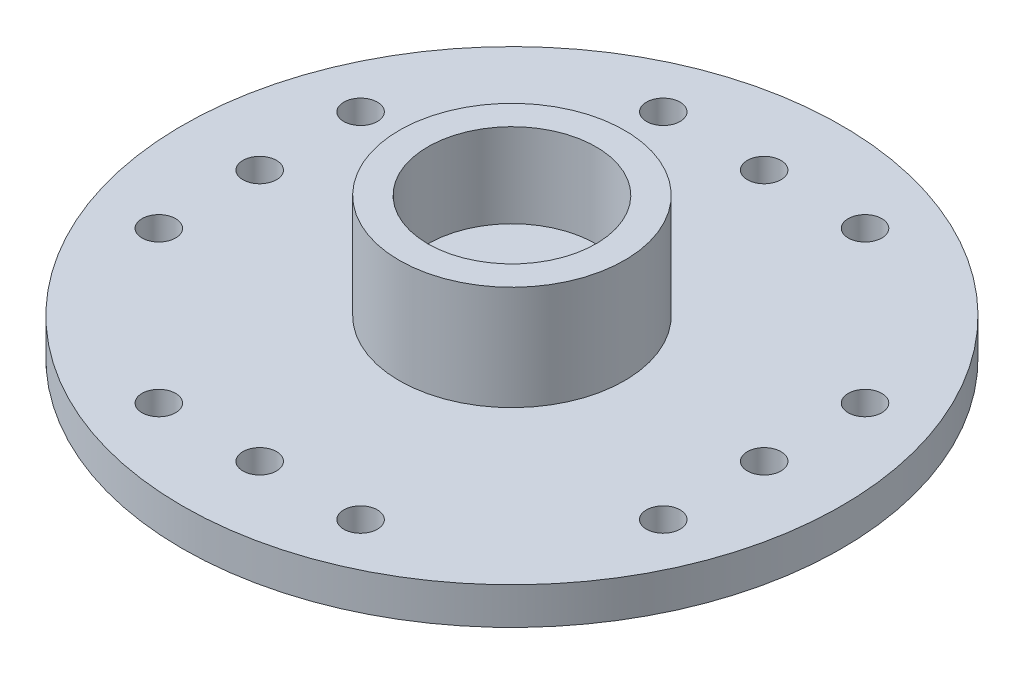
ISO-10303-21;
HEADER;
FILE_DESCRIPTION(('STEP AP214'),'2;1');
FILE_NAME('part.step','',(''),(''),'','','');
FILE_SCHEMA(('AUTOMOTIVE_DESIGN { 1 0 10303 214 1 1 1 1 }'));
ENDSEC;
DATA;
#1=APPLICATION_CONTEXT('core data for automotive mechanical design processes');
#2=APPLICATION_PROTOCOL_DEFINITION('international standard','automotive_design',2000,#1);
#3=PRODUCT_CONTEXT('',#1,'mechanical');
#4=PRODUCT('Part','Part','',(#3));
#5=PRODUCT_RELATED_PRODUCT_CATEGORY('part','',(#4));
#6=PRODUCT_DEFINITION_FORMATION('','',#4);
#7=PRODUCT_DEFINITION_CONTEXT('part definition',#1,'design');
#8=PRODUCT_DEFINITION('design','',#6,#7);
#9=PRODUCT_DEFINITION_SHAPE('','',#8);
#10=(LENGTH_UNIT() NAMED_UNIT(*) SI_UNIT(.MILLI.,.METRE.));
#11=(NAMED_UNIT(*) PLANE_ANGLE_UNIT() SI_UNIT($,.RADIAN.));
#12=(NAMED_UNIT(*) SI_UNIT($,.STERADIAN.) SOLID_ANGLE_UNIT());
#13=UNCERTAINTY_MEASURE_WITH_UNIT(LENGTH_MEASURE(1.E-05),#10,'distance_accuracy_value','');
#14=(GEOMETRIC_REPRESENTATION_CONTEXT(3) GLOBAL_UNCERTAINTY_ASSIGNED_CONTEXT((#13)) GLOBAL_UNIT_ASSIGNED_CONTEXT((#10,
#11,#12)) REPRESENTATION_CONTEXT('',''));
#15=CARTESIAN_POINT('',(0.,0.,0.));
#16=DIRECTION('',(0.,0.,1.));
#17=DIRECTION('',(1.,0.,0.));
#18=AXIS2_PLACEMENT_3D('',#15,#16,#17);
#19=CARTESIAN_POINT('',(0.,-0.000999999999999916,0.));
#20=DIRECTION('',(0.,1.,0.));
#21=DIRECTION('',(0.,0.,1.));
#22=AXIS2_PLACEMENT_3D('',#19,#20,#21);
#23=CYLINDRICAL_SURFACE('',#22,1.);
#24=CARTESIAN_POINT('',(0.,1.7,0.));
#25=DIRECTION('',(0.,1.,0.));
#26=DIRECTION('',(0.,0.,1.));
#27=AXIS2_PLACEMENT_3D('',#24,#25,#26);
#28=CIRCLE('',#27,1.);
#29=CARTESIAN_POINT('',(0.,1.7,1.));
#30=VERTEX_POINT('',#29);
#31=EDGE_CURVE('E54',#30,#30,#28,.T.);
#32=ORIENTED_EDGE('',*,*,#31,.T.);
#33=EDGE_LOOP('',(#32));
#34=FACE_BOUND('',#33,.T.);
#35=CARTESIAN_POINT('',(0.,0.5,0.));
#36=DIRECTION('',(0.,-1.,0.));
#37=DIRECTION('',(0.,0.,-1.));
#38=AXIS2_PLACEMENT_3D('',#35,#36,#37);
#39=CIRCLE('',#38,1.);
#40=CARTESIAN_POINT('',(0.,0.5,-1.));
#41=VERTEX_POINT('',#40);
#42=EDGE_CURVE('E34',#41,#41,#39,.F.);
#43=ORIENTED_EDGE('',*,*,#42,.F.);
#44=EDGE_LOOP('',(#43));
#45=FACE_BOUND('',#44,.T.);
#46=ADVANCED_FACE('F30',(#34,#45),#23,.F.);
#47=CARTESIAN_POINT('',(0.,1.1,0.));
#48=DIRECTION('',(0.,1.,0.));
#49=DIRECTION('',(0.,0.,1.));
#50=AXIS2_PLACEMENT_3D('',#47,#48,#49);
#51=PLANE('',#50);
#52=CARTESIAN_POINT('',(-7.49999999999997,1.1,3.00000000000008));
#53=DIRECTION('',(0.,1.,0.));
#54=DIRECTION('',(0.,0.,1.));
#55=AXIS2_PLACEMENT_3D('',#52,#53,#54);
#56=CIRCLE('',#55,0.499999999999999);
#57=CARTESIAN_POINT('',(-7.49999999999997,1.1,3.50000000000008));
#58=VERTEX_POINT('',#57);
#59=EDGE_CURVE('E131',#58,#58,#56,.T.);
#60=ORIENTED_EDGE('',*,*,#59,.F.);
#61=EDGE_LOOP('',(#60));
#62=FACE_BOUND('',#61,.T.);
#63=CARTESIAN_POINT('',(-7.5,1.1,0.));
#64=DIRECTION('',(0.,1.,0.));
#65=DIRECTION('',(0.,0.,1.));
#66=AXIS2_PLACEMENT_3D('',#63,#64,#65);
#67=CIRCLE('',#66,0.5);
#68=CARTESIAN_POINT('',(-7.5,1.1,0.500000000000078));
#69=VERTEX_POINT('',#68);
#70=EDGE_CURVE('E125',#69,#69,#67,.T.);
#71=ORIENTED_EDGE('',*,*,#70,.F.);
#72=EDGE_LOOP('',(#71));
#73=FACE_BOUND('',#72,.T.);
#74=CARTESIAN_POINT('',(-7.50000000000003,1.1,-2.99999999999992));
#75=DIRECTION('',(0.,1.,0.));
#76=DIRECTION('',(0.,0.,1.));
#77=AXIS2_PLACEMENT_3D('',#74,#75,#76);
#78=CIRCLE('',#77,0.5);
#79=CARTESIAN_POINT('',(-7.50000000000003,1.1,-2.49999999999992));
#80=VERTEX_POINT('',#79);
#81=EDGE_CURVE('E119',#80,#80,#78,.T.);
#82=ORIENTED_EDGE('',*,*,#81,.F.);
#83=EDGE_LOOP('',(#82));
#84=FACE_BOUND('',#83,.T.);
#85=CARTESIAN_POINT('',(-3.,1.1,-7.5));
#86=DIRECTION('',(0.,1.,0.));
#87=DIRECTION('',(0.,0.,1.));
#88=AXIS2_PLACEMENT_3D('',#85,#86,#87);
#89=CIRCLE('',#88,0.499999999999999);
#90=CARTESIAN_POINT('',(-3.,1.1,-7.));
#91=VERTEX_POINT('',#90);
#92=EDGE_CURVE('E113',#91,#91,#89,.T.);
#93=ORIENTED_EDGE('',*,*,#92,.F.);
#94=EDGE_LOOP('',(#93));
#95=FACE_BOUND('',#94,.T.);
#96=CARTESIAN_POINT('',(0.,1.1,-7.5));
#97=DIRECTION('',(0.,1.,0.));
#98=DIRECTION('',(0.,0.,1.));
#99=AXIS2_PLACEMENT_3D('',#96,#97,#98);
#100=CIRCLE('',#99,0.5);
#101=CARTESIAN_POINT('',(0.,1.1,-7.));
#102=VERTEX_POINT('',#101);
#103=EDGE_CURVE('E107',#102,#102,#100,.T.);
#104=ORIENTED_EDGE('',*,*,#103,.F.);
#105=EDGE_LOOP('',(#104));
#106=FACE_BOUND('',#105,.T.);
#107=CARTESIAN_POINT('',(3.,1.1,-7.5));
#108=DIRECTION('',(0.,1.,0.));
#109=DIRECTION('',(0.,0.,1.));
#110=AXIS2_PLACEMENT_3D('',#107,#108,#109);
#111=CIRCLE('',#110,0.5);
#112=CARTESIAN_POINT('',(3.,1.1,-7.));
#113=VERTEX_POINT('',#112);
#114=EDGE_CURVE('E101',#113,#113,#111,.T.);
#115=ORIENTED_EDGE('',*,*,#114,.F.);
#116=EDGE_LOOP('',(#115));
#117=FACE_BOUND('',#116,.T.);
#118=CARTESIAN_POINT('',(7.49999999999999,1.1,-3.00000000000003));
#119=DIRECTION('',(0.,1.,0.));
#120=DIRECTION('',(0.,0.,1.));
#121=AXIS2_PLACEMENT_3D('',#118,#119,#120);
#122=CIRCLE('',#121,0.499999999999999);
#123=CARTESIAN_POINT('',(7.49999999999999,1.1,-2.50000000000003));
#124=VERTEX_POINT('',#123);
#125=EDGE_CURVE('E95',#124,#124,#122,.T.);
#126=ORIENTED_EDGE('',*,*,#125,.F.);
#127=EDGE_LOOP('',(#126));
#128=FACE_BOUND('',#127,.T.);
#129=CARTESIAN_POINT('',(7.5,1.1,0.));
#130=DIRECTION('',(0.,1.,0.));
#131=DIRECTION('',(0.,0.,1.));
#132=AXIS2_PLACEMENT_3D('',#129,#130,#131);
#133=CIRCLE('',#132,0.5);
#134=CARTESIAN_POINT('',(7.5,1.1,0.499999999999975));
#135=VERTEX_POINT('',#134);
#136=EDGE_CURVE('E89',#135,#135,#133,.T.);
#137=ORIENTED_EDGE('',*,*,#136,.F.);
#138=EDGE_LOOP('',(#137));
#139=FACE_BOUND('',#138,.T.);
#140=CARTESIAN_POINT('',(7.50000000000001,1.1,2.99999999999998));
#141=DIRECTION('',(0.,1.,0.));
#142=DIRECTION('',(0.,0.,1.));
#143=AXIS2_PLACEMENT_3D('',#140,#141,#142);
#144=CIRCLE('',#143,0.5);
#145=CARTESIAN_POINT('',(7.50000000000001,1.1,3.49999999999998));
#146=VERTEX_POINT('',#145);
#147=EDGE_CURVE('E83',#146,#146,#144,.T.);
#148=ORIENTED_EDGE('',*,*,#147,.F.);
#149=EDGE_LOOP('',(#148));
#150=FACE_BOUND('',#149,.T.);
#151=CARTESIAN_POINT('',(3.,1.1,7.5));
#152=DIRECTION('',(0.,1.,0.));
#153=DIRECTION('',(0.,0.,1.));
#154=AXIS2_PLACEMENT_3D('',#151,#152,#153);
#155=CIRCLE('',#154,0.499999999999999);
#156=CARTESIAN_POINT('',(3.,1.1,8.));
#157=VERTEX_POINT('',#156);
#158=EDGE_CURVE('E77',#157,#157,#155,.T.);
#159=ORIENTED_EDGE('',*,*,#158,.F.);
#160=EDGE_LOOP('',(#159));
#161=FACE_BOUND('',#160,.T.);
#162=CARTESIAN_POINT('',(0.,1.1,7.5));
#163=DIRECTION('',(0.,1.,0.));
#164=DIRECTION('',(0.,0.,1.));
#165=AXIS2_PLACEMENT_3D('',#162,#163,#164);
#166=CIRCLE('',#165,0.5);
#167=CARTESIAN_POINT('',(0.,1.1,8.));
#168=VERTEX_POINT('',#167);
#169=EDGE_CURVE('E71',#168,#168,#166,.T.);
#170=ORIENTED_EDGE('',*,*,#169,.F.);
#171=EDGE_LOOP('',(#170));
#172=FACE_BOUND('',#171,.T.);
#173=CARTESIAN_POINT('',(-3.,1.1,7.5));
#174=DIRECTION('',(0.,1.,0.));
#175=DIRECTION('',(0.,0.,1.));
#176=AXIS2_PLACEMENT_3D('',#173,#174,#175);
#177=CIRCLE('',#176,0.5);
#178=CARTESIAN_POINT('',(-3.,1.1,8.));
#179=VERTEX_POINT('',#178);
#180=EDGE_CURVE('E63',#179,#179,#177,.T.);
#181=ORIENTED_EDGE('',*,*,#180,.F.);
#182=EDGE_LOOP('',(#181));
#183=FACE_BOUND('',#182,.T.);
#184=CARTESIAN_POINT('',(0.,1.1,0.));
#185=DIRECTION('',(0.,1.,0.));
#186=DIRECTION('',(0.,0.,1.));
#187=AXIS2_PLACEMENT_3D('',#184,#185,#186);
#188=CIRCLE('',#187,9.8);
#189=CARTESIAN_POINT('',(0.,1.1,9.8));
#190=VERTEX_POINT('',#189);
#191=EDGE_CURVE('E10',#190,#190,#188,.T.);
#192=ORIENTED_EDGE('',*,*,#191,.T.);
#193=EDGE_LOOP('',(#192));
#194=FACE_BOUND('',#193,.T.);
#195=CARTESIAN_POINT('',(0.,1.1,0.));
#196=DIRECTION('',(0.,1.,0.));
#197=DIRECTION('',(0.,0.,1.));
#198=AXIS2_PLACEMENT_3D('',#195,#196,#197);
#199=CIRCLE('',#198,3.35);
#200=CARTESIAN_POINT('',(0.,1.1,3.35));
#201=VERTEX_POINT('',#200);
#202=EDGE_CURVE('E45',#201,#201,#199,.T.);
#203=ORIENTED_EDGE('',*,*,#202,.F.);
#204=EDGE_LOOP('',(#203));
#205=FACE_BOUND('',#204,.T.);
#206=ADVANCED_FACE('F171',(#62,#73,#84,#95,#106,#117,#128,#139,#150,#161,#172,#183,#194,#205),
#51,.T.);
#207=CARTESIAN_POINT('',(0.,1.1,0.));
#208=DIRECTION('',(0.,-1.,0.));
#209=DIRECTION('',(0.,0.,-1.));
#210=AXIS2_PLACEMENT_3D('',#207,#208,#209);
#211=CYLINDRICAL_SURFACE('',#210,9.8);
#212=ORIENTED_EDGE('',*,*,#191,.F.);
#213=EDGE_LOOP('',(#212));
#214=FACE_BOUND('',#213,.T.);
#215=CARTESIAN_POINT('',(0.,0.,0.));
#216=DIRECTION('',(0.,1.,0.));
#217=DIRECTION('',(0.,0.,1.));
#218=AXIS2_PLACEMENT_3D('',#215,#216,#217);
#219=CIRCLE('',#218,9.8);
#220=CARTESIAN_POINT('',(0.,0.,9.8));
#221=VERTEX_POINT('',#220);
#222=EDGE_CURVE('E38',#221,#221,#219,.T.);
#223=ORIENTED_EDGE('',*,*,#222,.T.);
#224=EDGE_LOOP('',(#223));
#225=FACE_BOUND('',#224,.T.);
#226=ADVANCED_FACE('F32',(#214,#225),#211,.T.);
#227=CARTESIAN_POINT('',(0.,0.,0.));
#228=DIRECTION('',(0.,1.,0.));
#229=DIRECTION('',(0.,0.,1.));
#230=AXIS2_PLACEMENT_3D('',#227,#228,#229);
#231=PLANE('',#230);
#232=CARTESIAN_POINT('',(-7.49999999999997,0.,3.00000000000008));
#233=DIRECTION('',(0.,-1.,0.));
#234=DIRECTION('',(1.,0.,0.));
#235=AXIS2_PLACEMENT_3D('',#232,#233,#234);
#236=CIRCLE('',#235,0.499999999999999);
#237=CARTESIAN_POINT('',(-6.99999999999997,0.,3.00000000000007));
#238=VERTEX_POINT('',#237);
#239=EDGE_CURVE('E134',#238,#238,#236,.T.);
#240=ORIENTED_EDGE('',*,*,#239,.F.);
#241=EDGE_LOOP('',(#240));
#242=FACE_BOUND('',#241,.T.);
#243=CARTESIAN_POINT('',(-7.5,0.,0.));
#244=DIRECTION('',(0.,-1.,0.));
#245=DIRECTION('',(1.,0.,0.));
#246=AXIS2_PLACEMENT_3D('',#243,#244,#245);
#247=CIRCLE('',#246,0.5);
#248=CARTESIAN_POINT('',(-7.,0.,0.));
#249=VERTEX_POINT('',#248);
#250=EDGE_CURVE('E128',#249,#249,#247,.T.);
#251=ORIENTED_EDGE('',*,*,#250,.F.);
#252=EDGE_LOOP('',(#251));
#253=FACE_BOUND('',#252,.T.);
#254=CARTESIAN_POINT('',(-7.50000000000003,0.,-2.99999999999992));
#255=DIRECTION('',(0.,-1.,0.));
#256=DIRECTION('',(1.,0.,0.));
#257=AXIS2_PLACEMENT_3D('',#254,#255,#256);
#258=CIRCLE('',#257,0.5);
#259=CARTESIAN_POINT('',(-7.00000000000003,0.,-2.99999999999993));
#260=VERTEX_POINT('',#259);
#261=EDGE_CURVE('E122',#260,#260,#258,.T.);
#262=ORIENTED_EDGE('',*,*,#261,.F.);
#263=EDGE_LOOP('',(#262));
#264=FACE_BOUND('',#263,.T.);
#265=CARTESIAN_POINT('',(-3.,0.,-7.5));
#266=DIRECTION('',(0.,-1.,0.));
#267=DIRECTION('',(0.,0.,1.));
#268=AXIS2_PLACEMENT_3D('',#265,#266,#267);
#269=CIRCLE('',#268,0.499999999999999);
#270=CARTESIAN_POINT('',(-3.,0.,-7.));
#271=VERTEX_POINT('',#270);
#272=EDGE_CURVE('E116',#271,#271,#269,.T.);
#273=ORIENTED_EDGE('',*,*,#272,.F.);
#274=EDGE_LOOP('',(#273));
#275=FACE_BOUND('',#274,.T.);
#276=CARTESIAN_POINT('',(0.,0.,-7.5));
#277=DIRECTION('',(0.,-1.,0.));
#278=DIRECTION('',(0.,0.,1.));
#279=AXIS2_PLACEMENT_3D('',#276,#277,#278);
#280=CIRCLE('',#279,0.5);
#281=CARTESIAN_POINT('',(0.,0.,-7.));
#282=VERTEX_POINT('',#281);
#283=EDGE_CURVE('E110',#282,#282,#280,.T.);
#284=ORIENTED_EDGE('',*,*,#283,.F.);
#285=EDGE_LOOP('',(#284));
#286=FACE_BOUND('',#285,.T.);
#287=CARTESIAN_POINT('',(3.,0.,-7.5));
#288=DIRECTION('',(0.,-1.,0.));
#289=DIRECTION('',(0.,0.,1.));
#290=AXIS2_PLACEMENT_3D('',#287,#288,#289);
#291=CIRCLE('',#290,0.5);
#292=CARTESIAN_POINT('',(3.,0.,-7.));
#293=VERTEX_POINT('',#292);
#294=EDGE_CURVE('E104',#293,#293,#291,.T.);
#295=ORIENTED_EDGE('',*,*,#294,.F.);
#296=EDGE_LOOP('',(#295));
#297=FACE_BOUND('',#296,.T.);
#298=CARTESIAN_POINT('',(7.49999999999999,0.,-3.00000000000003));
#299=DIRECTION('',(0.,-1.,0.));
#300=DIRECTION('',(-1.,0.,0.));
#301=AXIS2_PLACEMENT_3D('',#298,#299,#300);
#302=CIRCLE('',#301,0.499999999999999);
#303=CARTESIAN_POINT('',(6.99999999999999,0.,-3.00000000000002));
#304=VERTEX_POINT('',#303);
#305=EDGE_CURVE('E98',#304,#304,#302,.T.);
#306=ORIENTED_EDGE('',*,*,#305,.F.);
#307=EDGE_LOOP('',(#306));
#308=FACE_BOUND('',#307,.T.);
#309=CARTESIAN_POINT('',(7.5,0.,0.));
#310=DIRECTION('',(0.,-1.,0.));
#311=DIRECTION('',(-1.,0.,0.));
#312=AXIS2_PLACEMENT_3D('',#309,#310,#311);
#313=CIRCLE('',#312,0.5);
#314=CARTESIAN_POINT('',(7.,0.,0.));
#315=VERTEX_POINT('',#314);
#316=EDGE_CURVE('E92',#315,#315,#313,.T.);
#317=ORIENTED_EDGE('',*,*,#316,.F.);
#318=EDGE_LOOP('',(#317));
#319=FACE_BOUND('',#318,.T.);
#320=CARTESIAN_POINT('',(7.50000000000001,0.,2.99999999999998));
#321=DIRECTION('',(0.,-1.,0.));
#322=DIRECTION('',(-1.,0.,0.));
#323=AXIS2_PLACEMENT_3D('',#320,#321,#322);
#324=CIRCLE('',#323,0.5);
#325=CARTESIAN_POINT('',(7.00000000000001,0.,2.99999999999998));
#326=VERTEX_POINT('',#325);
#327=EDGE_CURVE('E86',#326,#326,#324,.T.);
#328=ORIENTED_EDGE('',*,*,#327,.F.);
#329=EDGE_LOOP('',(#328));
#330=FACE_BOUND('',#329,.T.);
#331=CARTESIAN_POINT('',(3.,0.,7.5));
#332=DIRECTION('',(0.,-1.,0.));
#333=DIRECTION('',(0.,0.,-1.));
#334=AXIS2_PLACEMENT_3D('',#331,#332,#333);
#335=CIRCLE('',#334,0.499999999999999);
#336=CARTESIAN_POINT('',(3.,0.,7.));
#337=VERTEX_POINT('',#336);
#338=EDGE_CURVE('E80',#337,#337,#335,.T.);
#339=ORIENTED_EDGE('',*,*,#338,.F.);
#340=EDGE_LOOP('',(#339));
#341=FACE_BOUND('',#340,.T.);
#342=CARTESIAN_POINT('',(0.,0.,7.5));
#343=DIRECTION('',(0.,-1.,0.));
#344=DIRECTION('',(0.,0.,-1.));
#345=AXIS2_PLACEMENT_3D('',#342,#343,#344);
#346=CIRCLE('',#345,0.5);
#347=CARTESIAN_POINT('',(0.,0.,7.));
#348=VERTEX_POINT('',#347);
#349=EDGE_CURVE('E74',#348,#348,#346,.T.);
#350=ORIENTED_EDGE('',*,*,#349,.F.);
#351=EDGE_LOOP('',(#350));
#352=FACE_BOUND('',#351,.T.);
#353=CARTESIAN_POINT('',(-3.,0.,7.5));
#354=DIRECTION('',(0.,-1.,0.));
#355=DIRECTION('',(0.,0.,-1.));
#356=AXIS2_PLACEMENT_3D('',#353,#354,#355);
#357=CIRCLE('',#356,0.5);
#358=CARTESIAN_POINT('',(-3.,0.,7.));
#359=VERTEX_POINT('',#358);
#360=EDGE_CURVE('E68',#359,#359,#357,.T.);
#361=ORIENTED_EDGE('',*,*,#360,.F.);
#362=EDGE_LOOP('',(#361));
#363=FACE_BOUND('',#362,.T.);
#364=CARTESIAN_POINT('',(0.,0.,0.));
#365=DIRECTION('',(0.,-1.,0.));
#366=DIRECTION('',(0.,0.,-1.));
#367=AXIS2_PLACEMENT_3D('',#364,#365,#366);
#368=CIRCLE('',#367,2.);
#369=CARTESIAN_POINT('',(0.,0.,-2.));
#370=VERTEX_POINT('',#369);
#371=EDGE_CURVE('E59',#370,#370,#368,.T.);
#372=ORIENTED_EDGE('',*,*,#371,.F.);
#373=EDGE_LOOP('',(#372));
#374=FACE_BOUND('',#373,.T.);
#375=ORIENTED_EDGE('',*,*,#222,.F.);
#376=EDGE_LOOP('',(#375));
#377=FACE_BOUND('',#376,.T.);
#378=ADVANCED_FACE('F140',(#242,#253,#264,#275,#286,#297,#308,#319,#330,#341,#352,#363,#374,
#377),#231,.F.);
#379=CARTESIAN_POINT('',(0.,4.2,0.));
#380=DIRECTION('',(0.,-1.,0.));
#381=DIRECTION('',(0.,0.,-1.));
#382=AXIS2_PLACEMENT_3D('',#379,#380,#381);
#383=CYLINDRICAL_SURFACE('',#382,3.35);
#384=CARTESIAN_POINT('',(0.,4.2,0.));
#385=DIRECTION('',(0.,1.,0.));
#386=DIRECTION('',(0.,0.,1.));
#387=AXIS2_PLACEMENT_3D('',#384,#385,#386);
#388=CIRCLE('',#387,3.35);
#389=CARTESIAN_POINT('',(0.,4.2,3.35));
#390=VERTEX_POINT('',#389);
#391=EDGE_CURVE('E43',#390,#390,#388,.T.);
#392=ORIENTED_EDGE('',*,*,#391,.F.);
#393=EDGE_LOOP('',(#392));
#394=FACE_BOUND('',#393,.T.);
#395=ORIENTED_EDGE('',*,*,#202,.T.);
#396=EDGE_LOOP('',(#395));
#397=FACE_BOUND('',#396,.T.);
#398=ADVANCED_FACE('F143',(#394,#397),#383,.T.);
#399=CARTESIAN_POINT('',(0.,4.2,0.));
#400=DIRECTION('',(0.,1.,0.));
#401=DIRECTION('',(0.,0.,1.));
#402=AXIS2_PLACEMENT_3D('',#399,#400,#401);
#403=PLANE('',#402);
#404=CARTESIAN_POINT('',(0.,4.2,0.));
#405=DIRECTION('',(0.,1.,0.));
#406=DIRECTION('',(0.,0.,1.));
#407=AXIS2_PLACEMENT_3D('',#404,#405,#406);
#408=CIRCLE('',#407,2.5);
#409=CARTESIAN_POINT('',(0.,4.2,2.5));
#410=VERTEX_POINT('',#409);
#411=EDGE_CURVE('E51',#410,#410,#408,.T.);
#412=ORIENTED_EDGE('',*,*,#411,.F.);
#413=EDGE_LOOP('',(#412));
#414=FACE_BOUND('',#413,.T.);
#415=ORIENTED_EDGE('',*,*,#391,.T.);
#416=EDGE_LOOP('',(#415));
#417=FACE_BOUND('',#416,.T.);
#418=ADVANCED_FACE('F196',(#414,#417),#403,.T.);
#419=CARTESIAN_POINT('',(0.,1.7,0.));
#420=DIRECTION('',(0.,1.,0.));
#421=DIRECTION('',(0.,0.,1.));
#422=AXIS2_PLACEMENT_3D('',#419,#420,#421);
#423=CYLINDRICAL_SURFACE('',#422,2.5);
#424=CARTESIAN_POINT('',(0.,1.7,0.));
#425=DIRECTION('',(0.,1.,0.));
#426=DIRECTION('',(0.,0.,1.));
#427=AXIS2_PLACEMENT_3D('',#424,#425,#426);
#428=CIRCLE('',#427,2.5);
#429=CARTESIAN_POINT('',(0.,1.7,2.5));
#430=VERTEX_POINT('',#429);
#431=EDGE_CURVE('E48',#430,#430,#428,.T.);
#432=ORIENTED_EDGE('',*,*,#431,.F.);
#433=EDGE_LOOP('',(#432));
#434=FACE_BOUND('',#433,.T.);
#435=ORIENTED_EDGE('',*,*,#411,.T.);
#436=EDGE_LOOP('',(#435));
#437=FACE_BOUND('',#436,.T.);
#438=ADVANCED_FACE('F192',(#434,#437),#423,.F.);
#439=CARTESIAN_POINT('',(0.,1.7,0.));
#440=DIRECTION('',(0.,1.,0.));
#441=DIRECTION('',(0.,0.,1.));
#442=AXIS2_PLACEMENT_3D('',#439,#440,#441);
#443=PLANE('',#442);
#444=ORIENTED_EDGE('',*,*,#31,.F.);
#445=EDGE_LOOP('',(#444));
#446=FACE_BOUND('',#445,.T.);
#447=ORIENTED_EDGE('',*,*,#431,.T.);
#448=EDGE_LOOP('',(#447));
#449=FACE_BOUND('',#448,.T.);
#450=ADVANCED_FACE('F188',(#446,#449),#443,.T.);
#451=CARTESIAN_POINT('',(0.,0.5,0.));
#452=DIRECTION('',(0.,-1.,0.));
#453=DIRECTION('',(0.,0.,-1.));
#454=AXIS2_PLACEMENT_3D('',#451,#452,#453);
#455=PLANE('',#454);
#456=CARTESIAN_POINT('',(0.,0.5,0.));
#457=DIRECTION('',(0.,-1.,0.));
#458=DIRECTION('',(0.,0.,-1.));
#459=AXIS2_PLACEMENT_3D('',#456,#457,#458);
#460=CIRCLE('',#459,2.);
#461=CARTESIAN_POINT('',(0.,0.5,-2.));
#462=VERTEX_POINT('',#461);
#463=EDGE_CURVE('E62',#462,#462,#460,.T.);
#464=ORIENTED_EDGE('',*,*,#463,.T.);
#465=EDGE_LOOP('',(#464));
#466=FACE_BOUND('',#465,.T.);
#467=ORIENTED_EDGE('',*,*,#42,.T.);
#468=EDGE_LOOP('',(#467));
#469=FACE_BOUND('',#468,.T.);
#470=ADVANCED_FACE('F191',(#466,#469),#455,.T.);
#471=CARTESIAN_POINT('',(0.,0.5,0.));
#472=DIRECTION('',(0.,-1.,0.));
#473=DIRECTION('',(0.,0.,-1.));
#474=AXIS2_PLACEMENT_3D('',#471,#472,#473);
#475=CYLINDRICAL_SURFACE('',#474,2.);
#476=ORIENTED_EDGE('',*,*,#463,.F.);
#477=EDGE_LOOP('',(#476));
#478=FACE_BOUND('',#477,.T.);
#479=ORIENTED_EDGE('',*,*,#371,.T.);
#480=EDGE_LOOP('',(#479));
#481=FACE_BOUND('',#480,.T.);
#482=ADVANCED_FACE('F186',(#478,#481),#475,.F.);
#483=CARTESIAN_POINT('',(-3.,4.2,7.5));
#484=DIRECTION('',(0.,-1.,0.));
#485=DIRECTION('',(0.,0.,-1.));
#486=AXIS2_PLACEMENT_3D('',#483,#484,#485);
#487=CYLINDRICAL_SURFACE('',#486,0.5);
#488=ORIENTED_EDGE('',*,*,#180,.T.);
#489=EDGE_LOOP('',(#488));
#490=FACE_BOUND('',#489,.T.);
#491=ORIENTED_EDGE('',*,*,#360,.T.);
#492=EDGE_LOOP('',(#491));
#493=FACE_BOUND('',#492,.T.);
#494=ADVANCED_FACE('F236',(#490,#493),#487,.F.);
#495=CARTESIAN_POINT('',(0.,4.2,7.5));
#496=DIRECTION('',(0.,-1.,0.));
#497=DIRECTION('',(0.,0.,-1.));
#498=AXIS2_PLACEMENT_3D('',#495,#496,#497);
#499=CYLINDRICAL_SURFACE('',#498,0.5);
#500=ORIENTED_EDGE('',*,*,#169,.T.);
#501=EDGE_LOOP('',(#500));
#502=FACE_BOUND('',#501,.T.);
#503=ORIENTED_EDGE('',*,*,#349,.T.);
#504=EDGE_LOOP('',(#503));
#505=FACE_BOUND('',#504,.T.);
#506=ADVANCED_FACE('F243',(#502,#505),#499,.F.);
#507=CARTESIAN_POINT('',(3.,4.2,7.5));
#508=DIRECTION('',(0.,-1.,0.));
#509=DIRECTION('',(0.,0.,-1.));
#510=AXIS2_PLACEMENT_3D('',#507,#508,#509);
#511=CYLINDRICAL_SURFACE('',#510,0.499999999999999);
#512=ORIENTED_EDGE('',*,*,#158,.T.);
#513=EDGE_LOOP('',(#512));
#514=FACE_BOUND('',#513,.T.);
#515=ORIENTED_EDGE('',*,*,#338,.T.);
#516=EDGE_LOOP('',(#515));
#517=FACE_BOUND('',#516,.T.);
#518=ADVANCED_FACE('F251',(#514,#517),#511,.F.);
#519=CARTESIAN_POINT('',(7.50000000000001,4.2,2.99999999999998));
#520=DIRECTION('',(0.,-1.,0.));
#521=DIRECTION('',(0.,0.,-1.));
#522=AXIS2_PLACEMENT_3D('',#519,#520,#521);
#523=CYLINDRICAL_SURFACE('',#522,0.5);
#524=ORIENTED_EDGE('',*,*,#147,.T.);
#525=EDGE_LOOP('',(#524));
#526=FACE_BOUND('',#525,.T.);
#527=ORIENTED_EDGE('',*,*,#327,.T.);
#528=EDGE_LOOP('',(#527));
#529=FACE_BOUND('',#528,.T.);
#530=ADVANCED_FACE('F259',(#526,#529),#523,.F.);
#531=CARTESIAN_POINT('',(7.5,4.2,0.));
#532=DIRECTION('',(0.,-1.,0.));
#533=DIRECTION('',(0.,0.,-1.));
#534=AXIS2_PLACEMENT_3D('',#531,#532,#533);
#535=CYLINDRICAL_SURFACE('',#534,0.5);
#536=ORIENTED_EDGE('',*,*,#136,.T.);
#537=EDGE_LOOP('',(#536));
#538=FACE_BOUND('',#537,.T.);
#539=ORIENTED_EDGE('',*,*,#316,.T.);
#540=EDGE_LOOP('',(#539));
#541=FACE_BOUND('',#540,.T.);
#542=ADVANCED_FACE('F268',(#538,#541),#535,.F.);
#543=CARTESIAN_POINT('',(7.49999999999999,4.2,-3.00000000000003));
#544=DIRECTION('',(0.,-1.,0.));
#545=DIRECTION('',(0.,0.,-1.));
#546=AXIS2_PLACEMENT_3D('',#543,#544,#545);
#547=CYLINDRICAL_SURFACE('',#546,0.499999999999999);
#548=ORIENTED_EDGE('',*,*,#125,.T.);
#549=EDGE_LOOP('',(#548));
#550=FACE_BOUND('',#549,.T.);
#551=ORIENTED_EDGE('',*,*,#305,.T.);
#552=EDGE_LOOP('',(#551));
#553=FACE_BOUND('',#552,.T.);
#554=ADVANCED_FACE('F276',(#550,#553),#547,.F.);
#555=CARTESIAN_POINT('',(3.,4.2,-7.5));
#556=DIRECTION('',(0.,-1.,0.));
#557=DIRECTION('',(0.,0.,-1.));
#558=AXIS2_PLACEMENT_3D('',#555,#556,#557);
#559=CYLINDRICAL_SURFACE('',#558,0.5);
#560=ORIENTED_EDGE('',*,*,#114,.T.);
#561=EDGE_LOOP('',(#560));
#562=FACE_BOUND('',#561,.T.);
#563=ORIENTED_EDGE('',*,*,#294,.T.);
#564=EDGE_LOOP('',(#563));
#565=FACE_BOUND('',#564,.T.);
#566=ADVANCED_FACE('F284',(#562,#565),#559,.F.);
#567=CARTESIAN_POINT('',(0.,4.2,-7.5));
#568=DIRECTION('',(0.,-1.,0.));
#569=DIRECTION('',(0.,0.,-1.));
#570=AXIS2_PLACEMENT_3D('',#567,#568,#569);
#571=CYLINDRICAL_SURFACE('',#570,0.5);
#572=ORIENTED_EDGE('',*,*,#103,.T.);
#573=EDGE_LOOP('',(#572));
#574=FACE_BOUND('',#573,.T.);
#575=ORIENTED_EDGE('',*,*,#283,.T.);
#576=EDGE_LOOP('',(#575));
#577=FACE_BOUND('',#576,.T.);
#578=ADVANCED_FACE('F292',(#574,#577),#571,.F.);
#579=CARTESIAN_POINT('',(-3.,4.2,-7.5));
#580=DIRECTION('',(0.,-1.,0.));
#581=DIRECTION('',(0.,0.,-1.));
#582=AXIS2_PLACEMENT_3D('',#579,#580,#581);
#583=CYLINDRICAL_SURFACE('',#582,0.499999999999999);
#584=ORIENTED_EDGE('',*,*,#92,.T.);
#585=EDGE_LOOP('',(#584));
#586=FACE_BOUND('',#585,.T.);
#587=ORIENTED_EDGE('',*,*,#272,.T.);
#588=EDGE_LOOP('',(#587));
#589=FACE_BOUND('',#588,.T.);
#590=ADVANCED_FACE('F300',(#586,#589),#583,.F.);
#591=CARTESIAN_POINT('',(-7.50000000000003,4.2,-2.99999999999992));
#592=DIRECTION('',(0.,-1.,0.));
#593=DIRECTION('',(0.,0.,-1.));
#594=AXIS2_PLACEMENT_3D('',#591,#592,#593);
#595=CYLINDRICAL_SURFACE('',#594,0.5);
#596=ORIENTED_EDGE('',*,*,#81,.T.);
#597=EDGE_LOOP('',(#596));
#598=FACE_BOUND('',#597,.T.);
#599=ORIENTED_EDGE('',*,*,#261,.T.);
#600=EDGE_LOOP('',(#599));
#601=FACE_BOUND('',#600,.T.);
#602=ADVANCED_FACE('F308',(#598,#601),#595,.F.);
#603=CARTESIAN_POINT('',(-7.5,4.2,0.));
#604=DIRECTION('',(0.,-1.,0.));
#605=DIRECTION('',(0.,0.,-1.));
#606=AXIS2_PLACEMENT_3D('',#603,#604,#605);
#607=CYLINDRICAL_SURFACE('',#606,0.5);
#608=ORIENTED_EDGE('',*,*,#70,.T.);
#609=EDGE_LOOP('',(#608));
#610=FACE_BOUND('',#609,.T.);
#611=ORIENTED_EDGE('',*,*,#250,.T.);
#612=EDGE_LOOP('',(#611));
#613=FACE_BOUND('',#612,.T.);
#614=ADVANCED_FACE('F316',(#610,#613),#607,.F.);
#615=CARTESIAN_POINT('',(-7.49999999999997,4.2,3.00000000000008));
#616=DIRECTION('',(0.,-1.,0.));
#617=DIRECTION('',(0.,0.,-1.));
#618=AXIS2_PLACEMENT_3D('',#615,#616,#617);
#619=CYLINDRICAL_SURFACE('',#618,0.499999999999999);
#620=ORIENTED_EDGE('',*,*,#59,.T.);
#621=EDGE_LOOP('',(#620));
#622=FACE_BOUND('',#621,.T.);
#623=ORIENTED_EDGE('',*,*,#239,.T.);
#624=EDGE_LOOP('',(#623));
#625=FACE_BOUND('',#624,.T.);
#626=ADVANCED_FACE('F138',(#622,#625),#619,.F.);
#627=CLOSED_SHELL('',(#46,#206,#226,#378,#398,#418,#438,#450,#470,#482,#494,#506,#518,#530,#542,
#554,#566,#578,#590,#602,#614,#626));
#628=MANIFOLD_SOLID_BREP('B2',#627);
#629=ADVANCED_BREP_SHAPE_REPRESENTATION('',(#18,#628),#14);
#630=SHAPE_DEFINITION_REPRESENTATION(#9,#629);
ENDSEC;
END-ISO-10303-21;
